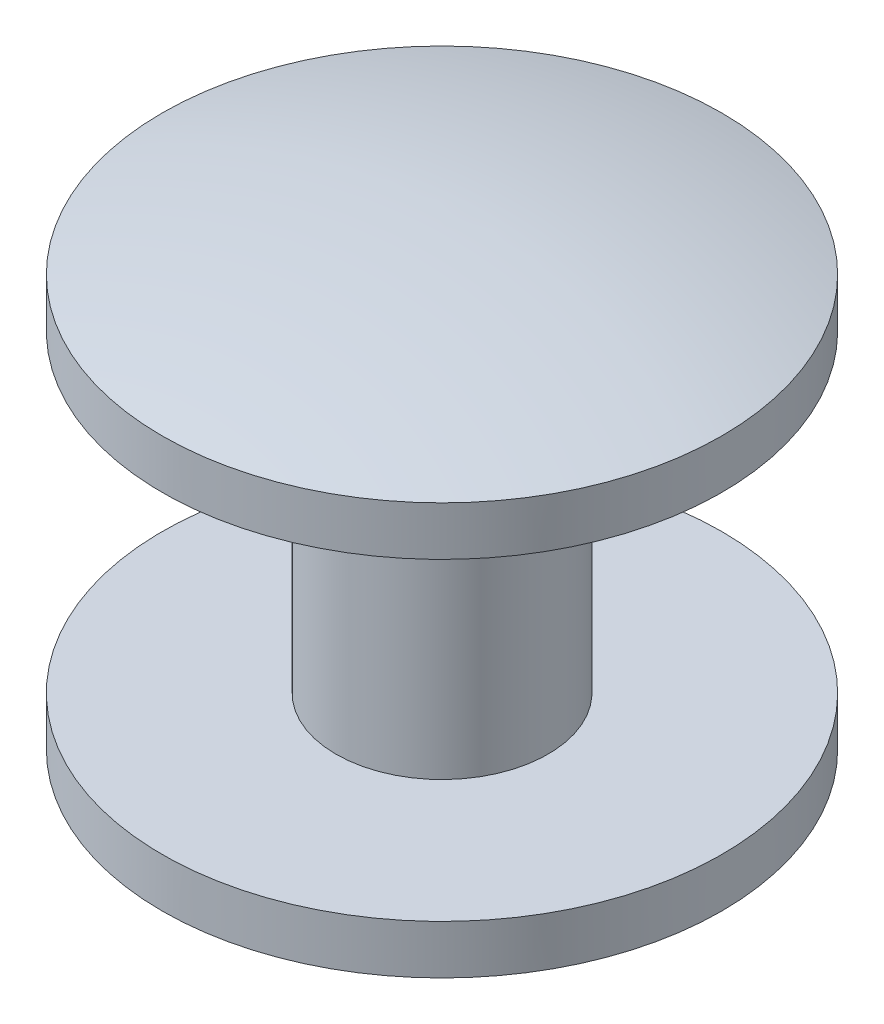
ISO-10303-21;
HEADER;
FILE_DESCRIPTION(('STEP AP214'),'2;1');
FILE_NAME('part.step','',(''),(''),'','','');
FILE_SCHEMA(('AUTOMOTIVE_DESIGN { 1 0 10303 214 1 1 1 1 }'));
ENDSEC;
DATA;
#1=APPLICATION_CONTEXT('core data for automotive mechanical design processes');
#2=APPLICATION_PROTOCOL_DEFINITION('international standard','automotive_design',2000,#1);
#3=PRODUCT_CONTEXT('',#1,'mechanical');
#4=PRODUCT('Part','Part','',(#3));
#5=PRODUCT_RELATED_PRODUCT_CATEGORY('part','',(#4));
#6=PRODUCT_DEFINITION_FORMATION('','',#4);
#7=PRODUCT_DEFINITION_CONTEXT('part definition',#1,'design');
#8=PRODUCT_DEFINITION('design','',#6,#7);
#9=PRODUCT_DEFINITION_SHAPE('','',#8);
#10=(LENGTH_UNIT() NAMED_UNIT(*) SI_UNIT(.MILLI.,.METRE.));
#11=(NAMED_UNIT(*) PLANE_ANGLE_UNIT() SI_UNIT($,.RADIAN.));
#12=(NAMED_UNIT(*) SI_UNIT($,.STERADIAN.) SOLID_ANGLE_UNIT());
#13=UNCERTAINTY_MEASURE_WITH_UNIT(LENGTH_MEASURE(1.E-05),#10,'distance_accuracy_value','');
#14=(GEOMETRIC_REPRESENTATION_CONTEXT(3) GLOBAL_UNCERTAINTY_ASSIGNED_CONTEXT((#13)) GLOBAL_UNIT_ASSIGNED_CONTEXT((#10,
#11,#12)) REPRESENTATION_CONTEXT('',''));
#15=CARTESIAN_POINT('',(0.,0.,0.));
#16=DIRECTION('',(0.,0.,1.));
#17=DIRECTION('',(1.,0.,0.));
#18=AXIS2_PLACEMENT_3D('',#15,#16,#17);
#19=CARTESIAN_POINT('',(0.,10.5,0.));
#20=DIRECTION('',(0.,-1.,0.));
#21=DIRECTION('',(0.,0.,-1.));
#22=AXIS2_PLACEMENT_3D('',#19,#20,#21);
#23=CYLINDRICAL_SURFACE('',#22,14.2786773106514);
#24=CARTESIAN_POINT('',(0.,-10.5,0.));
#25=DIRECTION('',(0.,1.,0.));
#26=DIRECTION('',(0.,0.,1.));
#27=AXIS2_PLACEMENT_3D('',#24,#25,#26);
#28=CIRCLE('',#27,14.2786773106514);
#29=CARTESIAN_POINT('',(0.,-10.5,-14.2786773106514));
#30=VERTEX_POINT('',#29);
#31=EDGE_CURVE('E42',#30,#30,#28,.T.);
#32=CARTESIAN_POINT('',(0.,-8.,0.));
#33=DIRECTION('',(0.,1.,0.));
#34=DIRECTION('',(0.,0.,1.));
#35=AXIS2_PLACEMENT_3D('',#32,#33,#34);
#36=CIRCLE('',#35,14.2786773106514);
#37=CARTESIAN_POINT('',(0.,-8.,-14.2786773106514));
#38=VERTEX_POINT('',#37);
#39=EDGE_CURVE('E46',#38,#38,#36,.T.);
#40=CARTESIAN_POINT('',(0.,-10.5,-14.2786773106514));
#41=CARTESIAN_POINT('',(0.,-10.4739583333333,-14.2786773106514));
#42=CARTESIAN_POINT('',(0.,-10.4479166666667,-14.2786773106514));
#43=CARTESIAN_POINT('',(0.,-10.3958333333333,-14.2786773106514));
#44=CARTESIAN_POINT('',(0.,-10.3697916666667,-14.2786773106514));
#45=CARTESIAN_POINT('',(0.,-10.3177083333333,-14.2786773106514));
#46=CARTESIAN_POINT('',(0.,-10.2916666666667,-14.2786773106514));
#47=CARTESIAN_POINT('',(0.,-10.2395833333333,-14.2786773106514));
#48=CARTESIAN_POINT('',(0.,-10.2135416666667,-14.2786773106514));
#49=CARTESIAN_POINT('',(0.,-10.1614583333333,-14.2786773106514));
#50=CARTESIAN_POINT('',(0.,-10.1354166666667,-14.2786773106514));
#51=CARTESIAN_POINT('',(0.,-10.0833333333333,-14.2786773106514));
#52=CARTESIAN_POINT('',(0.,-10.0572916666667,-14.2786773106514));
#53=CARTESIAN_POINT('',(0.,-10.0052083333333,-14.2786773106514));
#54=CARTESIAN_POINT('',(0.,-9.97916666666667,-14.2786773106514));
#55=CARTESIAN_POINT('',(0.,-9.92708333333333,-14.2786773106514));
#56=CARTESIAN_POINT('',(0.,-9.90104166666667,-14.2786773106514));
#57=CARTESIAN_POINT('',(0.,-9.84895833333333,-14.2786773106514));
#58=CARTESIAN_POINT('',(0.,-9.82291666666667,-14.2786773106514));
#59=CARTESIAN_POINT('',(0.,-9.77083333333333,-14.2786773106514));
#60=CARTESIAN_POINT('',(0.,-9.74479166666667,-14.2786773106514));
#61=CARTESIAN_POINT('',(0.,-9.69270833333333,-14.2786773106514));
#62=CARTESIAN_POINT('',(0.,-9.66666666666667,-14.2786773106514));
#63=CARTESIAN_POINT('',(0.,-9.61458333333333,-14.2786773106514));
#64=CARTESIAN_POINT('',(0.,-9.58854166666667,-14.2786773106514));
#65=CARTESIAN_POINT('',(0.,-9.53645833333333,-14.2786773106514));
#66=CARTESIAN_POINT('',(0.,-9.51041666666667,-14.2786773106514));
#67=CARTESIAN_POINT('',(0.,-9.45833333333333,-14.2786773106514));
#68=CARTESIAN_POINT('',(0.,-9.43229166666667,-14.2786773106514));
#69=CARTESIAN_POINT('',(0.,-9.38020833333333,-14.2786773106514));
#70=CARTESIAN_POINT('',(0.,-9.35416666666666,-14.2786773106514));
#71=CARTESIAN_POINT('',(0.,-9.30208333333333,-14.2786773106514));
#72=CARTESIAN_POINT('',(0.,-9.27604166666666,-14.2786773106514));
#73=CARTESIAN_POINT('',(0.,-9.22395833333333,-14.2786773106514));
#74=CARTESIAN_POINT('',(0.,-9.19791666666667,-14.2786773106514));
#75=CARTESIAN_POINT('',(0.,-9.14583333333333,-14.2786773106514));
#76=CARTESIAN_POINT('',(0.,-9.11979166666667,-14.2786773106514));
#77=CARTESIAN_POINT('',(0.,-9.06770833333333,-14.2786773106514));
#78=CARTESIAN_POINT('',(0.,-9.04166666666666,-14.2786773106514));
#79=CARTESIAN_POINT('',(0.,-8.98958333333333,-14.2786773106514));
#80=CARTESIAN_POINT('',(0.,-8.96354166666666,-14.2786773106514));
#81=CARTESIAN_POINT('',(0.,-8.91145833333333,-14.2786773106514));
#82=CARTESIAN_POINT('',(0.,-8.88541666666667,-14.2786773106514));
#83=CARTESIAN_POINT('',(0.,-8.83333333333333,-14.2786773106514));
#84=CARTESIAN_POINT('',(0.,-8.80729166666667,-14.2786773106514));
#85=CARTESIAN_POINT('',(0.,-8.75520833333333,-14.2786773106514));
#86=CARTESIAN_POINT('',(0.,-8.72916666666666,-14.2786773106514));
#87=CARTESIAN_POINT('',(0.,-8.67708333333333,-14.2786773106514));
#88=CARTESIAN_POINT('',(0.,-8.65104166666666,-14.2786773106514));
#89=CARTESIAN_POINT('',(0.,-8.59895833333333,-14.2786773106514));
#90=CARTESIAN_POINT('',(0.,-8.57291666666667,-14.2786773106514));
#91=CARTESIAN_POINT('',(0.,-8.52083333333333,-14.2786773106514));
#92=CARTESIAN_POINT('',(0.,-8.49479166666667,-14.2786773106514));
#93=CARTESIAN_POINT('',(0.,-8.44270833333333,-14.2786773106514));
#94=CARTESIAN_POINT('',(0.,-8.41666666666666,-14.2786773106514));
#95=CARTESIAN_POINT('',(0.,-8.36458333333333,-14.2786773106514));
#96=CARTESIAN_POINT('',(0.,-8.33854166666666,-14.2786773106514));
#97=CARTESIAN_POINT('',(0.,-8.28645833333333,-14.2786773106514));
#98=CARTESIAN_POINT('',(0.,-8.26041666666667,-14.2786773106514));
#99=CARTESIAN_POINT('',(0.,-8.20833333333333,-14.2786773106514));
#100=CARTESIAN_POINT('',(0.,-8.18229166666667,-14.2786773106514));
#101=CARTESIAN_POINT('',(0.,-8.13020833333333,-14.2786773106514));
#102=CARTESIAN_POINT('',(0.,-8.10416666666666,-14.2786773106514));
#103=CARTESIAN_POINT('',(0.,-8.05208333333333,-14.2786773106514));
#104=CARTESIAN_POINT('',(0.,-8.02604166666666,-14.2786773106514));
#105=CARTESIAN_POINT('',(0.,-8.,-14.2786773106514));
#106=B_SPLINE_CURVE_WITH_KNOTS('',3,(#40,#41,#42,#43,#44,#45,#46,#47,#48,#49,#50,#51,#52,#53,
#54,#55,#56,#57,#58,#59,#60,#61,#62,#63,#64,#65,#66,#67,#68,#69,#70,#71,#72,#73,#74,#75,#76,#77,
#78,#79,#80,#81,#82,#83,#84,#85,#86,#87,#88,#89,#90,#91,#92,#93,#94,#95,#96,#97,#98,#99,#100,
#101,#102,#103,#104,#105),.UNSPECIFIED.,.F.,.F.,(4,2,2,2,2,2,2,2,2,2,2,2,2,2,2,2,2,2,2,2,2,2,2,
2,2,2,2,2,2,2,2,2,4),(0.,0.0781249999999983,0.15625,0.234375000000002,0.3125,0.390624999999999,
0.46875,0.546875000000002,0.625000000000001,0.703124999999999,0.781250000000001,
0.859375000000002,0.937500000000001,1.015625,1.09375,1.171875,1.25,1.328125,1.40625,1.484375,
1.5625,1.640625,1.71875,1.796875,1.875,1.953125,2.03125,2.109375,2.1875,2.265625,2.34375,
2.421875,2.5),.UNSPECIFIED.);
#107=EDGE_CURVE('BSEAM35',#30,#38,#106,.T.);
#108=ORIENTED_EDGE('',*,*,#31,.T.);
#109=ORIENTED_EDGE('',*,*,#39,.F.);
#110=ORIENTED_EDGE('',*,*,#107,.T.);
#111=ORIENTED_EDGE('',*,*,#107,.F.);
#112=EDGE_LOOP('',(#108,#110,#109,#111));
#113=FACE_BOUND('',#112,.T.);
#114=ADVANCED_FACE('F35',(#113),#23,.T.);
#115=CARTESIAN_POINT('',(0.,39.470156435428,0.));
#116=DIRECTION('',(0.,0.,1.));
#117=DIRECTION('',(1.,0.,0.));
#118=AXIS2_PLACEMENT_3D('',#115,#116,#117);
#119=SPHERICAL_SURFACE('',#118,51.970156435428);
#120=CARTESIAN_POINT('',(0.,39.470156435428,0.));
#121=DIRECTION('',(0.,1.,0.));
#122=DIRECTION('',(0.,0.,1.));
#123=AXIS2_PLACEMENT_3D('',#120,#121,#122);
#124=SPHERICAL_SURFACE('',#123,51.970156435428);
#125=ORIENTED_EDGE('',*,*,#31,.F.);
#126=EDGE_LOOP('',(#125));
#127=FACE_BOUND('',#126,.T.);
#128=ADVANCED_FACE('F73',(#127),#124,.T.);
#129=CARTESIAN_POINT('',(0.,-8.,0.));
#130=DIRECTION('',(0.,1.,0.));
#131=DIRECTION('',(0.,0.,1.));
#132=AXIS2_PLACEMENT_3D('',#129,#130,#131);
#133=CYLINDRICAL_SURFACE('',#132,5.41173144118846);
#134=CARTESIAN_POINT('',(0.,-8.,0.));
#135=DIRECTION('',(0.,1.,0.));
#136=DIRECTION('',(0.,0.,1.));
#137=AXIS2_PLACEMENT_3D('',#134,#135,#136);
#138=CIRCLE('',#137,5.41173144118846);
#139=CARTESIAN_POINT('',(0.,-8.,5.41173144118846));
#140=VERTEX_POINT('',#139);
#141=EDGE_CURVE('E50',#140,#140,#138,.T.);
#142=ORIENTED_EDGE('',*,*,#141,.T.);
#143=EDGE_LOOP('',(#142));
#144=FACE_BOUND('',#143,.T.);
#145=CARTESIAN_POINT('',(0.,8.,0.));
#146=DIRECTION('',(0.,1.,0.));
#147=DIRECTION('',(0.,0.,1.));
#148=AXIS2_PLACEMENT_3D('',#145,#146,#147);
#149=CIRCLE('',#148,5.41173144118846);
#150=CARTESIAN_POINT('',(0.,8.,5.41173144118846));
#151=VERTEX_POINT('',#150);
#152=EDGE_CURVE('E56',#151,#151,#149,.T.);
#153=ORIENTED_EDGE('',*,*,#152,.F.);
#154=EDGE_LOOP('',(#153));
#155=FACE_BOUND('',#154,.T.);
#156=ADVANCED_FACE('F62',(#144,#155),#133,.T.);
#157=CARTESIAN_POINT('',(0.,-8.,0.));
#158=DIRECTION('',(0.,1.,0.));
#159=DIRECTION('',(0.,0.,1.));
#160=AXIS2_PLACEMENT_3D('',#157,#158,#159);
#161=PLANE('',#160);
#162=ORIENTED_EDGE('',*,*,#141,.F.);
#163=EDGE_LOOP('',(#162));
#164=FACE_BOUND('',#163,.T.);
#165=ORIENTED_EDGE('',*,*,#39,.T.);
#166=EDGE_LOOP('',(#165));
#167=FACE_BOUND('',#166,.T.);
#168=ADVANCED_FACE('F65',(#164,#167),#161,.T.);
#169=CARTESIAN_POINT('',(0.,8.,0.));
#170=DIRECTION('',(0.,1.,0.));
#171=DIRECTION('',(0.,0.,1.));
#172=AXIS2_PLACEMENT_3D('',#169,#170,#171);
#173=PLANE('',#172);
#174=ORIENTED_EDGE('',*,*,#152,.T.);
#175=EDGE_LOOP('',(#174));
#176=FACE_BOUND('',#175,.T.);
#177=CARTESIAN_POINT('',(0.,8.,0.));
#178=DIRECTION('',(0.,1.,0.));
#179=DIRECTION('',(0.,0.,1.));
#180=AXIS2_PLACEMENT_3D('',#177,#178,#179);
#181=CIRCLE('',#180,14.2786773106514);
#182=CARTESIAN_POINT('',(0.,8.,-14.2786773106514));
#183=VERTEX_POINT('',#182);
#184=EDGE_CURVE('E53',#183,#183,#181,.T.);
#185=ORIENTED_EDGE('',*,*,#184,.F.);
#186=EDGE_LOOP('',(#185));
#187=FACE_BOUND('',#186,.T.);
#188=ADVANCED_FACE('F68',(#176,#187),#173,.F.);
#189=CARTESIAN_POINT('',(0.,-39.470156435428,0.));
#190=DIRECTION('',(0.,0.,1.));
#191=DIRECTION('',(1.,0.,0.));
#192=AXIS2_PLACEMENT_3D('',#189,#190,#191);
#193=SPHERICAL_SURFACE('',#192,51.970156435428);
#194=CARTESIAN_POINT('',(0.,-39.470156435428,0.));
#195=DIRECTION('',(0.,1.,0.));
#196=DIRECTION('',(0.,0.,1.));
#197=AXIS2_PLACEMENT_3D('',#194,#195,#196);
#198=SPHERICAL_SURFACE('',#197,51.970156435428);
#199=CARTESIAN_POINT('',(0.,10.5,0.));
#200=DIRECTION('',(0.,1.,0.));
#201=DIRECTION('',(0.,0.,1.));
#202=AXIS2_PLACEMENT_3D('',#199,#200,#201);
#203=CIRCLE('',#202,14.2786773106514);
#204=CARTESIAN_POINT('',(0.,10.5,-14.2786773106514));
#205=VERTEX_POINT('',#204);
#206=EDGE_CURVE('E10',#205,#205,#203,.T.);
#207=ORIENTED_EDGE('',*,*,#206,.T.);
#208=EDGE_LOOP('',(#207));
#209=FACE_BOUND('',#208,.T.);
#210=ADVANCED_FACE('F37',(#209),#198,.T.);
#211=CARTESIAN_POINT('',(0.,8.,-14.2786773106514));
#212=CARTESIAN_POINT('',(0.,8.02604166666667,-14.2786773106514));
#213=CARTESIAN_POINT('',(0.,8.05208333333333,-14.2786773106514));
#214=CARTESIAN_POINT('',(0.,8.10416666666667,-14.2786773106514));
#215=CARTESIAN_POINT('',(0.,8.13020833333333,-14.2786773106514));
#216=CARTESIAN_POINT('',(0.,8.18229166666667,-14.2786773106514));
#217=CARTESIAN_POINT('',(0.,8.20833333333333,-14.2786773106514));
#218=CARTESIAN_POINT('',(0.,8.26041666666667,-14.2786773106514));
#219=CARTESIAN_POINT('',(0.,8.28645833333333,-14.2786773106514));
#220=CARTESIAN_POINT('',(0.,8.33854166666667,-14.2786773106514));
#221=CARTESIAN_POINT('',(0.,8.36458333333333,-14.2786773106514));
#222=CARTESIAN_POINT('',(0.,8.41666666666667,-14.2786773106514));
#223=CARTESIAN_POINT('',(0.,8.44270833333333,-14.2786773106514));
#224=CARTESIAN_POINT('',(0.,8.49479166666667,-14.2786773106514));
#225=CARTESIAN_POINT('',(0.,8.52083333333333,-14.2786773106514));
#226=CARTESIAN_POINT('',(0.,8.57291666666667,-14.2786773106514));
#227=CARTESIAN_POINT('',(0.,8.59895833333333,-14.2786773106514));
#228=CARTESIAN_POINT('',(0.,8.65104166666667,-14.2786773106514));
#229=CARTESIAN_POINT('',(0.,8.67708333333333,-14.2786773106514));
#230=CARTESIAN_POINT('',(0.,8.72916666666667,-14.2786773106514));
#231=CARTESIAN_POINT('',(0.,8.75520833333333,-14.2786773106514));
#232=CARTESIAN_POINT('',(0.,8.80729166666667,-14.2786773106514));
#233=CARTESIAN_POINT('',(0.,8.83333333333333,-14.2786773106514));
#234=CARTESIAN_POINT('',(0.,8.88541666666667,-14.2786773106514));
#235=CARTESIAN_POINT('',(0.,8.91145833333333,-14.2786773106514));
#236=CARTESIAN_POINT('',(0.,8.96354166666667,-14.2786773106514));
#237=CARTESIAN_POINT('',(0.,8.98958333333333,-14.2786773106514));
#238=CARTESIAN_POINT('',(0.,9.04166666666667,-14.2786773106514));
#239=CARTESIAN_POINT('',(0.,9.06770833333333,-14.2786773106514));
#240=CARTESIAN_POINT('',(0.,9.11979166666667,-14.2786773106514));
#241=CARTESIAN_POINT('',(0.,9.14583333333333,-14.2786773106514));
#242=CARTESIAN_POINT('',(0.,9.19791666666667,-14.2786773106514));
#243=CARTESIAN_POINT('',(0.,9.22395833333333,-14.2786773106514));
#244=CARTESIAN_POINT('',(0.,9.27604166666667,-14.2786773106514));
#245=CARTESIAN_POINT('',(0.,9.30208333333333,-14.2786773106514));
#246=CARTESIAN_POINT('',(0.,9.35416666666667,-14.2786773106514));
#247=CARTESIAN_POINT('',(0.,9.38020833333333,-14.2786773106514));
#248=CARTESIAN_POINT('',(0.,9.43229166666667,-14.2786773106514));
#249=CARTESIAN_POINT('',(0.,9.45833333333333,-14.2786773106514));
#250=CARTESIAN_POINT('',(0.,9.51041666666667,-14.2786773106514));
#251=CARTESIAN_POINT('',(0.,9.53645833333333,-14.2786773106514));
#252=CARTESIAN_POINT('',(0.,9.58854166666667,-14.2786773106514));
#253=CARTESIAN_POINT('',(0.,9.61458333333333,-14.2786773106514));
#254=CARTESIAN_POINT('',(0.,9.66666666666667,-14.2786773106514));
#255=CARTESIAN_POINT('',(0.,9.69270833333333,-14.2786773106514));
#256=CARTESIAN_POINT('',(0.,9.74479166666667,-14.2786773106514));
#257=CARTESIAN_POINT('',(0.,9.77083333333333,-14.2786773106514));
#258=CARTESIAN_POINT('',(0.,9.82291666666667,-14.2786773106514));
#259=CARTESIAN_POINT('',(0.,9.84895833333333,-14.2786773106514));
#260=CARTESIAN_POINT('',(0.,9.90104166666667,-14.2786773106514));
#261=CARTESIAN_POINT('',(0.,9.92708333333333,-14.2786773106514));
#262=CARTESIAN_POINT('',(0.,9.97916666666667,-14.2786773106514));
#263=CARTESIAN_POINT('',(0.,10.0052083333333,-14.2786773106514));
#264=CARTESIAN_POINT('',(0.,10.0572916666667,-14.2786773106514));
#265=CARTESIAN_POINT('',(0.,10.0833333333333,-14.2786773106514));
#266=CARTESIAN_POINT('',(0.,10.1354166666667,-14.2786773106514));
#267=CARTESIAN_POINT('',(0.,10.1614583333333,-14.2786773106514));
#268=CARTESIAN_POINT('',(0.,10.2135416666667,-14.2786773106514));
#269=CARTESIAN_POINT('',(0.,10.2395833333333,-14.2786773106514));
#270=CARTESIAN_POINT('',(0.,10.2916666666667,-14.2786773106514));
#271=CARTESIAN_POINT('',(0.,10.3177083333333,-14.2786773106514));
#272=CARTESIAN_POINT('',(0.,10.3697916666667,-14.2786773106514));
#273=CARTESIAN_POINT('',(0.,10.3958333333333,-14.2786773106514));
#274=CARTESIAN_POINT('',(0.,10.4479166666667,-14.2786773106514));
#275=CARTESIAN_POINT('',(0.,10.4739583333333,-14.2786773106514));
#276=CARTESIAN_POINT('',(0.,10.5,-14.2786773106514));
#277=B_SPLINE_CURVE_WITH_KNOTS('',3,(#211,#212,#213,#214,#215,#216,#217,#218,#219,#220,#221,
#222,#223,#224,#225,#226,#227,#228,#229,#230,#231,#232,#233,#234,#235,#236,#237,#238,#239,#240,
#241,#242,#243,#244,#245,#246,#247,#248,#249,#250,#251,#252,#253,#254,#255,#256,#257,#258,#259,
#260,#261,#262,#263,#264,#265,#266,#267,#268,#269,#270,#271,#272,#273,#274,#275,#276),
.UNSPECIFIED.,.F.,.F.,(4,2,2,2,2,2,2,2,2,2,2,2,2,2,2,2,2,2,2,2,2,2,2,2,2,2,2,2,2,2,2,2,4),(0.,
0.0781250000000001,0.15625,0.234375,0.3125,0.390625,0.46875,0.546875,0.625000000000001,
0.703125000000001,0.781250000000001,0.859375000000001,0.937500000000001,1.015625,1.09375,
1.171875,1.25,1.328125,1.40625,1.484375,1.5625,1.640625,1.71875,1.796875,1.875,1.953125,2.03125,
2.109375,2.1875,2.265625,2.34375,2.421875,2.5),.UNSPECIFIED.);
#278=EDGE_CURVE('BSEAM75',#183,#205,#277,.T.);
#279=ORIENTED_EDGE('',*,*,#184,.T.);
#280=ORIENTED_EDGE('',*,*,#206,.F.);
#281=ORIENTED_EDGE('',*,*,#278,.T.);
#282=ORIENTED_EDGE('',*,*,#278,.F.);
#283=EDGE_LOOP('',(#279,#281,#280,#282));
#284=FACE_BOUND('',#283,.T.);
#285=ADVANCED_FACE('F75',(#284),#23,.T.);
#286=CLOSED_SHELL('',(#114,#128,#156,#168,#188,#210,#285));
#287=MANIFOLD_SOLID_BREP('B2',#286);
#288=ADVANCED_BREP_SHAPE_REPRESENTATION('',(#18,#287),#14);
#289=SHAPE_DEFINITION_REPRESENTATION(#9,#288);
ENDSEC;
END-ISO-10303-21;
